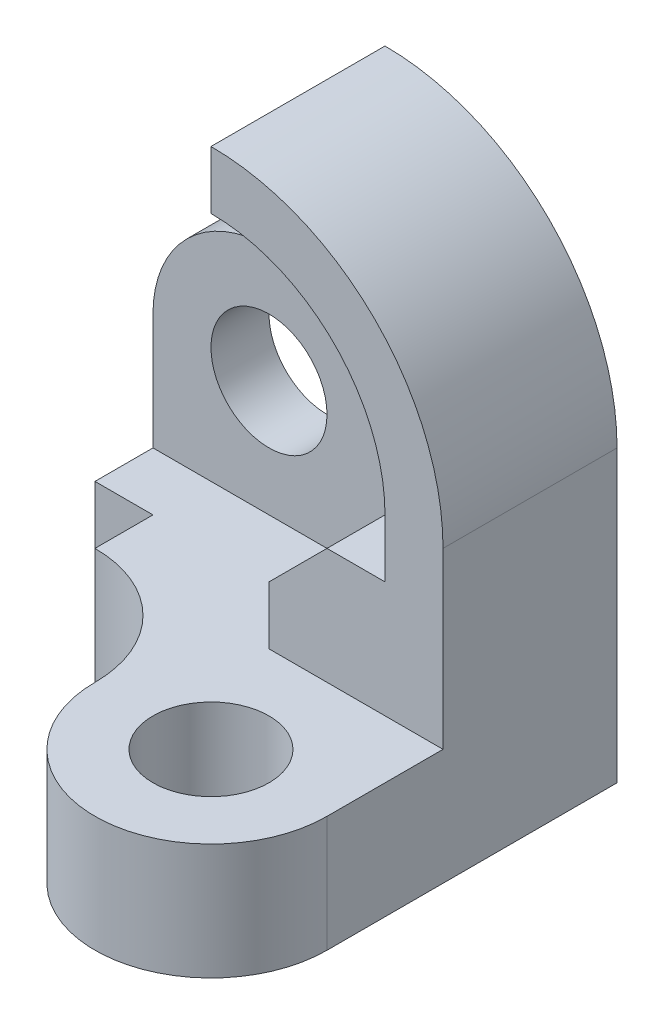
ISO-10303-21;
HEADER;
FILE_DESCRIPTION(('STEP AP214'),'2;1');
FILE_NAME('part.step','',(''),(''),'','','');
FILE_SCHEMA(('AUTOMOTIVE_DESIGN { 1 0 10303 214 1 1 1 1 }'));
ENDSEC;
DATA;
#1=APPLICATION_CONTEXT('core data for automotive mechanical design processes');
#2=APPLICATION_PROTOCOL_DEFINITION('international standard','automotive_design',2000,#1);
#3=PRODUCT_CONTEXT('',#1,'mechanical');
#4=PRODUCT('Part','Part','',(#3));
#5=PRODUCT_RELATED_PRODUCT_CATEGORY('part','',(#4));
#6=PRODUCT_DEFINITION_FORMATION('','',#4);
#7=PRODUCT_DEFINITION_CONTEXT('part definition',#1,'design');
#8=PRODUCT_DEFINITION('design','',#6,#7);
#9=PRODUCT_DEFINITION_SHAPE('','',#8);
#10=(LENGTH_UNIT() NAMED_UNIT(*) SI_UNIT(.MILLI.,.METRE.));
#11=(NAMED_UNIT(*) PLANE_ANGLE_UNIT() SI_UNIT($,.RADIAN.));
#12=(NAMED_UNIT(*) SI_UNIT($,.STERADIAN.) SOLID_ANGLE_UNIT());
#13=UNCERTAINTY_MEASURE_WITH_UNIT(LENGTH_MEASURE(1.E-05),#10,'distance_accuracy_value','');
#14=(GEOMETRIC_REPRESENTATION_CONTEXT(3) GLOBAL_UNCERTAINTY_ASSIGNED_CONTEXT((#13)) GLOBAL_UNIT_ASSIGNED_CONTEXT((#10,
#11,#12)) REPRESENTATION_CONTEXT('',''));
#15=CARTESIAN_POINT('',(0.,0.,0.));
#16=DIRECTION('',(0.,0.,1.));
#17=DIRECTION('',(1.,0.,0.));
#18=AXIS2_PLACEMENT_3D('',#15,#16,#17);
#19=CARTESIAN_POINT('',(0.,0.,10.));
#20=DIRECTION('',(0.,0.,-1.));
#21=DIRECTION('',(-1.,0.,0.));
#22=AXIS2_PLACEMENT_3D('',#19,#20,#21);
#23=PLANE('',#22);
#24=CARTESIAN_POINT('',(-10.,-10.,10.));
#25=DIRECTION('',(0.,0.,1.));
#26=DIRECTION('',(1.,0.,0.));
#27=AXIS2_PLACEMENT_3D('',#24,#25,#26);
#28=CIRCLE('',#27,10.);
#29=CARTESIAN_POINT('',(0.,-10.,10.));
#30=VERTEX_POINT('',#29);
#31=EDGE_CURVE('E207',#30,#30,#28,.T.);
#32=ORIENTED_EDGE('',*,*,#31,.F.);
#33=EDGE_LOOP('',(#32));
#34=FACE_BOUND('',#33,.T.);
#35=DIRECTION('',(-1.,0.,0.));
#36=VECTOR('',#35,1.);
#37=CARTESIAN_POINT('',(40.,-30.,10.));
#38=LINE('',#37,#36);
#39=CARTESIAN_POINT('',(10.,-30.,10.));
#40=VERTEX_POINT('',#39);
#41=CARTESIAN_POINT('',(-30.,-30.,10.));
#42=VERTEX_POINT('',#41);
#43=EDGE_CURVE('E200',#40,#42,#38,.T.);
#44=ORIENTED_EDGE('',*,*,#43,.F.);
#45=DIRECTION('',(0.,1.,0.));
#46=VECTOR('',#45,1.);
#47=CARTESIAN_POINT('',(10.,-20.,10.));
#48=LINE('',#47,#46);
#49=CARTESIAN_POINT('',(10.,-20.,10.));
#50=VERTEX_POINT('',#49);
#51=EDGE_CURVE('E243',#40,#50,#48,.T.);
#52=ORIENTED_EDGE('',*,*,#51,.T.);
#53=DIRECTION('',(0.707106781186547,0.707106781186548,0.));
#54=VECTOR('',#53,1.);
#55=CARTESIAN_POINT('',(20.,-10.,10.));
#56=LINE('',#55,#54);
#57=CARTESIAN_POINT('',(20.,-10.,10.));
#58=VERTEX_POINT('',#57);
#59=EDGE_CURVE('E245',#50,#58,#56,.T.);
#60=ORIENTED_EDGE('',*,*,#59,.T.);
#61=DIRECTION('',(1.,0.,0.));
#62=VECTOR('',#61,1.);
#63=CARTESIAN_POINT('',(30.,-10.,10.));
#64=LINE('',#63,#62);
#65=CARTESIAN_POINT('',(30.,-10.,10.));
#66=VERTEX_POINT('',#65);
#67=EDGE_CURVE('E247',#58,#66,#64,.T.);
#68=ORIENTED_EDGE('',*,*,#67,.T.);
#69=DIRECTION('',(0.,1.,0.));
#70=VECTOR('',#69,1.);
#71=CARTESIAN_POINT('',(30.,0.,10.));
#72=LINE('',#71,#70);
#73=CARTESIAN_POINT('',(30.,0.,10.));
#74=VERTEX_POINT('',#73);
#75=EDGE_CURVE('E249',#66,#74,#72,.T.);
#76=ORIENTED_EDGE('',*,*,#75,.T.);
#77=CARTESIAN_POINT('',(0.,0.,10.));
#78=DIRECTION('',(0.,0.,-1.));
#79=DIRECTION('',(-1.,0.,0.));
#80=AXIS2_PLACEMENT_3D('',#77,#78,#79);
#81=CIRCLE('',#80,30.);
#82=CARTESIAN_POINT('',(0.,30.,10.));
#83=VERTEX_POINT('',#82);
#84=EDGE_CURVE('E251',#74,#83,#81,.F.);
#85=ORIENTED_EDGE('',*,*,#84,.T.);
#86=DIRECTION('',(0.,-1.,0.));
#87=VECTOR('',#86,1.);
#88=CARTESIAN_POINT('',(0.,40.,10.));
#89=LINE('',#88,#87);
#90=CARTESIAN_POINT('',(0.,10.,10.));
#91=VERTEX_POINT('',#90);
#92=EDGE_CURVE('E213',#83,#91,#89,.T.);
#93=ORIENTED_EDGE('',*,*,#92,.T.);
#94=DIRECTION('',(-1.,0.,0.));
#95=VECTOR('',#94,1.);
#96=CARTESIAN_POINT('',(0.,10.,10.));
#97=LINE('',#96,#95);
#98=CARTESIAN_POINT('',(-10.,10.,10.));
#99=VERTEX_POINT('',#98);
#100=EDGE_CURVE('E215',#91,#99,#97,.T.);
#101=ORIENTED_EDGE('',*,*,#100,.T.);
#102=CARTESIAN_POINT('',(-10.,-10.,10.));
#103=DIRECTION('',(0.,0.,1.));
#104=DIRECTION('',(1.,0.,0.));
#105=AXIS2_PLACEMENT_3D('',#102,#103,#104);
#106=CIRCLE('',#105,20.);
#107=CARTESIAN_POINT('',(-30.,-10.,10.));
#108=VERTEX_POINT('',#107);
#109=EDGE_CURVE('E218',#99,#108,#106,.T.);
#110=ORIENTED_EDGE('',*,*,#109,.T.);
#111=DIRECTION('',(0.,-1.,0.));
#112=VECTOR('',#111,1.);
#113=CARTESIAN_POINT('',(-30.,-10.,10.));
#114=LINE('',#113,#112);
#115=EDGE_CURVE('E220',#108,#42,#114,.T.);
#116=ORIENTED_EDGE('',*,*,#115,.T.);
#117=EDGE_LOOP('',(#44,#52,#60,#68,#76,#85,#93,#101,#110,#116));
#118=FACE_BOUND('',#117,.T.);
#119=ADVANCED_FACE('F33',(#34,#118),#23,.F.);
#120=CARTESIAN_POINT('',(0.,0.,30.));
#121=DIRECTION('',(0.,0.,-1.));
#122=DIRECTION('',(-1.,0.,0.));
#123=AXIS2_PLACEMENT_3D('',#120,#121,#122);
#124=CYLINDRICAL_SURFACE('',#123,30.);
#125=ORIENTED_EDGE('',*,*,#84,.F.);
#126=DIRECTION('',(0.,0.,-1.));
#127=VECTOR('',#126,1.);
#128=CARTESIAN_POINT('',(30.,0.,30.));
#129=LINE('',#128,#127);
#130=CARTESIAN_POINT('',(30.,0.,30.));
#131=VERTEX_POINT('',#130);
#132=EDGE_CURVE('E295',#131,#74,#129,.T.);
#133=ORIENTED_EDGE('',*,*,#132,.F.);
#134=CARTESIAN_POINT('',(0.,0.,30.));
#135=DIRECTION('',(0.,0.,-1.));
#136=DIRECTION('',(1.,0.,0.));
#137=AXIS2_PLACEMENT_3D('',#134,#135,#136);
#138=CIRCLE('',#137,30.);
#139=CARTESIAN_POINT('',(0.,30.,30.));
#140=VERTEX_POINT('',#139);
#141=EDGE_CURVE('E260',#140,#131,#138,.T.);
#142=ORIENTED_EDGE('',*,*,#141,.F.);
#143=DIRECTION('',(0.,0.,-1.));
#144=VECTOR('',#143,1.);
#145=CARTESIAN_POINT('',(0.,30.,30.));
#146=LINE('',#145,#144);
#147=EDGE_CURVE('E41',#140,#83,#146,.T.);
#148=ORIENTED_EDGE('',*,*,#147,.T.);
#149=EDGE_LOOP('',(#125,#133,#142,#148));
#150=FACE_BOUND('',#149,.T.);
#151=ADVANCED_FACE('F302',(#150),#124,.F.);
#152=CARTESIAN_POINT('',(30.,0.,30.));
#153=DIRECTION('',(1.,0.,0.));
#154=DIRECTION('',(0.,0.,-1.));
#155=AXIS2_PLACEMENT_3D('',#152,#153,#154);
#156=PLANE('',#155);
#157=ORIENTED_EDGE('',*,*,#75,.F.);
#158=DIRECTION('',(0.,0.,-1.));
#159=VECTOR('',#158,1.);
#160=CARTESIAN_POINT('',(30.,-10.,30.));
#161=LINE('',#160,#159);
#162=CARTESIAN_POINT('',(30.,-10.,30.));
#163=VERTEX_POINT('',#162);
#164=EDGE_CURVE('E292',#163,#66,#161,.T.);
#165=ORIENTED_EDGE('',*,*,#164,.F.);
#166=DIRECTION('',(0.,-1.,0.));
#167=VECTOR('',#166,1.);
#168=CARTESIAN_POINT('',(30.,0.,30.));
#169=LINE('',#168,#167);
#170=EDGE_CURVE('E262',#131,#163,#169,.T.);
#171=ORIENTED_EDGE('',*,*,#170,.F.);
#172=ORIENTED_EDGE('',*,*,#132,.T.);
#173=EDGE_LOOP('',(#157,#165,#171,#172));
#174=FACE_BOUND('',#173,.T.);
#175=ADVANCED_FACE('F315',(#174),#156,.F.);
#176=CARTESIAN_POINT('',(30.,-10.,30.));
#177=DIRECTION('',(0.,-1.,0.));
#178=DIRECTION('',(0.,0.,-1.));
#179=AXIS2_PLACEMENT_3D('',#176,#177,#178);
#180=PLANE('',#179);
#181=ORIENTED_EDGE('',*,*,#67,.F.);
#182=DIRECTION('',(0.,0.,-1.));
#183=VECTOR('',#182,1.);
#184=CARTESIAN_POINT('',(20.,-10.,30.));
#185=LINE('',#184,#183);
#186=CARTESIAN_POINT('',(20.,-10.,30.));
#187=VERTEX_POINT('',#186);
#188=EDGE_CURVE('E289',#187,#58,#185,.T.);
#189=ORIENTED_EDGE('',*,*,#188,.F.);
#190=DIRECTION('',(-1.,0.,0.));
#191=VECTOR('',#190,1.);
#192=CARTESIAN_POINT('',(30.,-10.,30.));
#193=LINE('',#192,#191);
#194=EDGE_CURVE('E264',#163,#187,#193,.T.);
#195=ORIENTED_EDGE('',*,*,#194,.F.);
#196=ORIENTED_EDGE('',*,*,#164,.T.);
#197=EDGE_LOOP('',(#181,#189,#195,#196));
#198=FACE_BOUND('',#197,.T.);
#199=ADVANCED_FACE('F319',(#198),#180,.F.);
#200=CARTESIAN_POINT('',(20.,-10.,30.));
#201=DIRECTION('',(0.707106781186548,-0.707106781186547,0.));
#202=DIRECTION('',(0.707106781186547,0.707106781186548,0.));
#203=AXIS2_PLACEMENT_3D('',#200,#201,#202);
#204=PLANE('',#203);
#205=ORIENTED_EDGE('',*,*,#59,.F.);
#206=DIRECTION('',(0.,0.,-1.));
#207=VECTOR('',#206,1.);
#208=CARTESIAN_POINT('',(10.,-20.,30.));
#209=LINE('',#208,#207);
#210=CARTESIAN_POINT('',(10.,-20.,30.));
#211=VERTEX_POINT('',#210);
#212=EDGE_CURVE('E286',#211,#50,#209,.T.);
#213=ORIENTED_EDGE('',*,*,#212,.F.);
#214=DIRECTION('',(-0.707106781186547,-0.707106781186548,0.));
#215=VECTOR('',#214,1.);
#216=CARTESIAN_POINT('',(20.,-10.,30.));
#217=LINE('',#216,#215);
#218=EDGE_CURVE('E266',#187,#211,#217,.T.);
#219=ORIENTED_EDGE('',*,*,#218,.F.);
#220=ORIENTED_EDGE('',*,*,#188,.T.);
#221=EDGE_LOOP('',(#205,#213,#219,#220));
#222=FACE_BOUND('',#221,.T.);
#223=ADVANCED_FACE('F353',(#222),#204,.F.);
#224=CARTESIAN_POINT('',(10.,-20.,30.));
#225=DIRECTION('',(1.,0.,0.));
#226=DIRECTION('',(0.,0.,-1.));
#227=AXIS2_PLACEMENT_3D('',#224,#225,#226);
#228=PLANE('',#227);
#229=ORIENTED_EDGE('',*,*,#51,.F.);
#230=DIRECTION('',(0.,0.,-1.));
#231=VECTOR('',#230,1.);
#232=CARTESIAN_POINT('',(10.,-30.,30.));
#233=LINE('',#232,#231);
#234=CARTESIAN_POINT('',(10.,-30.,30.));
#235=VERTEX_POINT('',#234);
#236=EDGE_CURVE('E283',#235,#40,#233,.T.);
#237=ORIENTED_EDGE('',*,*,#236,.F.);
#238=DIRECTION('',(0.,-1.,0.));
#239=VECTOR('',#238,1.);
#240=CARTESIAN_POINT('',(10.,-20.,30.));
#241=LINE('',#240,#239);
#242=EDGE_CURVE('E268',#211,#235,#241,.T.);
#243=ORIENTED_EDGE('',*,*,#242,.F.);
#244=ORIENTED_EDGE('',*,*,#212,.T.);
#245=EDGE_LOOP('',(#229,#237,#243,#244));
#246=FACE_BOUND('',#245,.T.);
#247=ADVANCED_FACE('F350',(#246),#228,.F.);
#248=CARTESIAN_POINT('',(0.,0.,30.));
#249=DIRECTION('',(0.,0.,-1.));
#250=DIRECTION('',(-1.,0.,0.));
#251=AXIS2_PLACEMENT_3D('',#248,#249,#250);
#252=CYLINDRICAL_SURFACE('',#251,40.);
#253=CARTESIAN_POINT('',(0.,0.,0.));
#254=DIRECTION('',(0.,0.,1.));
#255=DIRECTION('',(1.,0.,0.));
#256=AXIS2_PLACEMENT_3D('',#253,#254,#255);
#257=CIRCLE('',#256,40.);
#258=CARTESIAN_POINT('',(40.,0.,0.));
#259=VERTEX_POINT('',#258);
#260=CARTESIAN_POINT('',(0.,40.,0.));
#261=VERTEX_POINT('',#260);
#262=EDGE_CURVE('E253',#259,#261,#257,.T.);
#263=ORIENTED_EDGE('',*,*,#262,.T.);
#264=DIRECTION('',(0.,0.,-1.));
#265=VECTOR('',#264,1.);
#266=CARTESIAN_POINT('',(0.,40.,30.));
#267=LINE('',#266,#265);
#268=CARTESIAN_POINT('',(0.,40.,30.));
#269=VERTEX_POINT('',#268);
#270=EDGE_CURVE('E11',#269,#261,#267,.T.);
#271=ORIENTED_EDGE('',*,*,#270,.F.);
#272=CARTESIAN_POINT('',(0.,0.,30.));
#273=DIRECTION('',(0.,0.,1.));
#274=DIRECTION('',(1.,0.,0.));
#275=AXIS2_PLACEMENT_3D('',#272,#273,#274);
#276=CIRCLE('',#275,40.);
#277=CARTESIAN_POINT('',(40.,0.,30.));
#278=VERTEX_POINT('',#277);
#279=EDGE_CURVE('E254',#278,#269,#276,.T.);
#280=ORIENTED_EDGE('',*,*,#279,.F.);
#281=DIRECTION('',(0.,0.,-1.));
#282=VECTOR('',#281,1.);
#283=CARTESIAN_POINT('',(40.,0.,30.));
#284=LINE('',#283,#282);
#285=EDGE_CURVE('E275',#278,#259,#284,.T.);
#286=ORIENTED_EDGE('',*,*,#285,.T.);
#287=EDGE_LOOP('',(#263,#271,#280,#286));
#288=FACE_BOUND('',#287,.T.);
#289=ADVANCED_FACE('F35',(#288),#252,.T.);
#290=CARTESIAN_POINT('',(0.,30.,30.));
#291=DIRECTION('',(1.,0.,0.));
#292=DIRECTION('',(0.,0.,-1.));
#293=AXIS2_PLACEMENT_3D('',#290,#291,#292);
#294=PLANE('',#293);
#295=DIRECTION('',(0.,-1.,0.));
#296=VECTOR('',#295,1.);
#297=CARTESIAN_POINT('',(0.,30.,0.));
#298=LINE('',#297,#296);
#299=CARTESIAN_POINT('',(0.,10.,0.));
#300=VERTEX_POINT('',#299);
#301=EDGE_CURVE('E278',#261,#300,#298,.T.);
#302=ORIENTED_EDGE('',*,*,#301,.T.);
#303=DIRECTION('',(0.,0.,-1.));
#304=VECTOR('',#303,1.);
#305=CARTESIAN_POINT('',(0.,10.,10.));
#306=LINE('',#305,#304);
#307=EDGE_CURVE('E240',#91,#300,#306,.T.);
#308=ORIENTED_EDGE('',*,*,#307,.F.);
#309=ORIENTED_EDGE('',*,*,#92,.F.);
#310=ORIENTED_EDGE('',*,*,#147,.F.);
#311=DIRECTION('',(0.,-1.,0.));
#312=VECTOR('',#311,1.);
#313=CARTESIAN_POINT('',(0.,30.,30.));
#314=LINE('',#313,#312);
#315=EDGE_CURVE('E257',#269,#140,#314,.T.);
#316=ORIENTED_EDGE('',*,*,#315,.F.);
#317=ORIENTED_EDGE('',*,*,#270,.T.);
#318=EDGE_LOOP('',(#302,#308,#309,#310,#316,#317));
#319=FACE_BOUND('',#318,.T.);
#320=ADVANCED_FACE('F306',(#319),#294,.F.);
#321=CARTESIAN_POINT('',(40.,-30.,30.));
#322=DIRECTION('',(-1.,0.,0.));
#323=DIRECTION('',(0.,0.,1.));
#324=AXIS2_PLACEMENT_3D('',#321,#322,#323);
#325=PLANE('',#324);
#326=DIRECTION('',(0.,0.,-1.));
#327=VECTOR('',#326,1.);
#328=CARTESIAN_POINT('',(40.,-30.,80.));
#329=LINE('',#328,#327);
#330=CARTESIAN_POINT('',(40.,-30.,50.));
#331=VERTEX_POINT('',#330);
#332=CARTESIAN_POINT('',(40.,-30.,30.));
#333=VERTEX_POINT('',#332);
#334=EDGE_CURVE('E204',#331,#333,#329,.T.);
#335=ORIENTED_EDGE('',*,*,#334,.F.);
#336=DIRECTION('',(0.,1.,0.));
#337=VECTOR('',#336,1.);
#338=CARTESIAN_POINT('',(40.,-80.,50.));
#339=LINE('',#338,#337);
#340=CARTESIAN_POINT('',(40.,-50.,50.));
#341=VERTEX_POINT('',#340);
#342=EDGE_CURVE('E185',#341,#331,#339,.T.);
#343=ORIENTED_EDGE('',*,*,#342,.F.);
#344=DIRECTION('',(0.,0.,-1.));
#345=VECTOR('',#344,1.);
#346=CARTESIAN_POINT('',(40.,-50.,10.));
#347=LINE('',#346,#345);
#348=CARTESIAN_POINT('',(40.,-50.,0.));
#349=VERTEX_POINT('',#348);
#350=EDGE_CURVE('E222',#341,#349,#347,.T.);
#351=ORIENTED_EDGE('',*,*,#350,.T.);
#352=DIRECTION('',(0.,1.,0.));
#353=VECTOR('',#352,1.);
#354=CARTESIAN_POINT('',(40.,-30.,0.));
#355=LINE('',#354,#353);
#356=EDGE_CURVE('E258',#349,#259,#355,.T.);
#357=ORIENTED_EDGE('',*,*,#356,.T.);
#358=ORIENTED_EDGE('',*,*,#285,.F.);
#359=DIRECTION('',(0.,1.,0.));
#360=VECTOR('',#359,1.);
#361=CARTESIAN_POINT('',(40.,-30.,30.));
#362=LINE('',#361,#360);
#363=EDGE_CURVE('E273',#333,#278,#362,.T.);
#364=ORIENTED_EDGE('',*,*,#363,.F.);
#365=EDGE_LOOP('',(#335,#343,#351,#357,#358,#364));
#366=FACE_BOUND('',#365,.T.);
#367=ADVANCED_FACE('F389',(#366),#325,.F.);
#368=CARTESIAN_POINT('',(0.,0.,30.));
#369=DIRECTION('',(0.,0.,1.));
#370=DIRECTION('',(1.,0.,0.));
#371=AXIS2_PLACEMENT_3D('',#368,#369,#370);
#372=PLANE('',#371);
#373=ORIENTED_EDGE('',*,*,#279,.T.);
#374=ORIENTED_EDGE('',*,*,#315,.T.);
#375=ORIENTED_EDGE('',*,*,#141,.T.);
#376=ORIENTED_EDGE('',*,*,#170,.T.);
#377=ORIENTED_EDGE('',*,*,#194,.T.);
#378=ORIENTED_EDGE('',*,*,#218,.T.);
#379=ORIENTED_EDGE('',*,*,#242,.T.);
#380=DIRECTION('',(1.,0.,0.));
#381=VECTOR('',#380,1.);
#382=CARTESIAN_POINT('',(10.,-30.,30.));
#383=LINE('',#382,#381);
#384=EDGE_CURVE('E270',#235,#333,#383,.T.);
#385=ORIENTED_EDGE('',*,*,#384,.T.);
#386=ORIENTED_EDGE('',*,*,#363,.T.);
#387=EDGE_LOOP('',(#373,#374,#375,#376,#377,#378,#379,#385,#386));
#388=FACE_BOUND('',#387,.T.);
#389=ADVANCED_FACE('F323',(#388),#372,.T.);
#390=CARTESIAN_POINT('',(0.,0.,0.));
#391=DIRECTION('',(0.,0.,1.));
#392=DIRECTION('',(1.,0.,0.));
#393=AXIS2_PLACEMENT_3D('',#390,#391,#392);
#394=PLANE('',#393);
#395=ORIENTED_EDGE('',*,*,#262,.F.);
#396=ORIENTED_EDGE('',*,*,#356,.F.);
#397=DIRECTION('',(1.,0.,0.));
#398=VECTOR('',#397,1.);
#399=CARTESIAN_POINT('',(-30.,-50.,0.));
#400=LINE('',#399,#398);
#401=CARTESIAN_POINT('',(-30.,-50.,0.));
#402=VERTEX_POINT('',#401);
#403=EDGE_CURVE('E216',#402,#349,#400,.T.);
#404=ORIENTED_EDGE('',*,*,#403,.F.);
#405=DIRECTION('',(0.,-1.,0.));
#406=VECTOR('',#405,1.);
#407=CARTESIAN_POINT('',(-30.,-10.,0.));
#408=LINE('',#407,#406);
#409=CARTESIAN_POINT('',(-30.,-10.,0.));
#410=VERTEX_POINT('',#409);
#411=EDGE_CURVE('E226',#410,#402,#408,.T.);
#412=ORIENTED_EDGE('',*,*,#411,.F.);
#413=CARTESIAN_POINT('',(-10.,-10.,0.));
#414=DIRECTION('',(0.,0.,1.));
#415=DIRECTION('',(1.,0.,0.));
#416=AXIS2_PLACEMENT_3D('',#413,#414,#415);
#417=CIRCLE('',#416,20.);
#418=CARTESIAN_POINT('',(-10.,10.,0.));
#419=VERTEX_POINT('',#418);
#420=EDGE_CURVE('E224',#419,#410,#417,.T.);
#421=ORIENTED_EDGE('',*,*,#420,.F.);
#422=DIRECTION('',(-1.,0.,0.));
#423=VECTOR('',#422,1.);
#424=CARTESIAN_POINT('',(0.,10.,0.));
#425=LINE('',#424,#423);
#426=EDGE_CURVE('E210',#300,#419,#425,.T.);
#427=ORIENTED_EDGE('',*,*,#426,.F.);
#428=ORIENTED_EDGE('',*,*,#301,.F.);
#429=EDGE_LOOP('',(#395,#396,#404,#412,#421,#427,#428));
#430=FACE_BOUND('',#429,.T.);
#431=CARTESIAN_POINT('',(-10.,-10.,0.));
#432=DIRECTION('',(0.,0.,1.));
#433=DIRECTION('',(1.,0.,0.));
#434=AXIS2_PLACEMENT_3D('',#431,#432,#433);
#435=CIRCLE('',#434,10.);
#436=CARTESIAN_POINT('',(0.,-10.,0.));
#437=VERTEX_POINT('',#436);
#438=EDGE_CURVE('E206',#437,#437,#435,.T.);
#439=ORIENTED_EDGE('',*,*,#438,.T.);
#440=EDGE_LOOP('',(#439));
#441=FACE_BOUND('',#440,.T.);
#442=ADVANCED_FACE('F334',(#430,#441),#394,.F.);
#443=CARTESIAN_POINT('',(0.,10.,10.));
#444=DIRECTION('',(0.,-1.,0.));
#445=DIRECTION('',(1.,0.,0.));
#446=AXIS2_PLACEMENT_3D('',#443,#444,#445);
#447=PLANE('',#446);
#448=ORIENTED_EDGE('',*,*,#426,.T.);
#449=DIRECTION('',(0.,0.,-1.));
#450=VECTOR('',#449,1.);
#451=CARTESIAN_POINT('',(-10.,10.,10.));
#452=LINE('',#451,#450);
#453=EDGE_CURVE('E237',#99,#419,#452,.T.);
#454=ORIENTED_EDGE('',*,*,#453,.F.);
#455=ORIENTED_EDGE('',*,*,#100,.F.);
#456=ORIENTED_EDGE('',*,*,#307,.T.);
#457=EDGE_LOOP('',(#448,#454,#455,#456));
#458=FACE_BOUND('',#457,.T.);
#459=ADVANCED_FACE('F340',(#458),#447,.F.);
#460=CARTESIAN_POINT('',(-10.,-10.,10.));
#461=DIRECTION('',(0.,0.,-1.));
#462=DIRECTION('',(-1.,0.,0.));
#463=AXIS2_PLACEMENT_3D('',#460,#461,#462);
#464=CYLINDRICAL_SURFACE('',#463,20.);
#465=ORIENTED_EDGE('',*,*,#420,.T.);
#466=DIRECTION('',(0.,0.,-1.));
#467=VECTOR('',#466,1.);
#468=CARTESIAN_POINT('',(-30.,-10.,10.));
#469=LINE('',#468,#467);
#470=EDGE_CURVE('E234',#108,#410,#469,.T.);
#471=ORIENTED_EDGE('',*,*,#470,.F.);
#472=ORIENTED_EDGE('',*,*,#109,.F.);
#473=ORIENTED_EDGE('',*,*,#453,.T.);
#474=EDGE_LOOP('',(#465,#471,#472,#473));
#475=FACE_BOUND('',#474,.T.);
#476=ADVANCED_FACE('F343',(#475),#464,.T.);
#477=CARTESIAN_POINT('',(-30.,-10.,10.));
#478=DIRECTION('',(1.,0.,0.));
#479=DIRECTION('',(0.,1.,0.));
#480=AXIS2_PLACEMENT_3D('',#477,#478,#479);
#481=PLANE('',#480);
#482=DIRECTION('',(0.,0.,-1.));
#483=VECTOR('',#482,1.);
#484=CARTESIAN_POINT('',(-30.,-50.,10.));
#485=LINE('',#484,#483);
#486=CARTESIAN_POINT('',(-30.,-50.,19.9999999999998));
#487=VERTEX_POINT('',#486);
#488=EDGE_CURVE('E232',#487,#402,#485,.T.);
#489=ORIENTED_EDGE('',*,*,#488,.F.);
#490=DIRECTION('',(0.,1.,0.));
#491=VECTOR('',#490,1.);
#492=CARTESIAN_POINT('',(-30.,-80.,19.9999999999998));
#493=LINE('',#492,#491);
#494=CARTESIAN_POINT('',(-30.,-30.,19.9999999999998));
#495=VERTEX_POINT('',#494);
#496=EDGE_CURVE('E188',#487,#495,#493,.T.);
#497=ORIENTED_EDGE('',*,*,#496,.T.);
#498=DIRECTION('',(0.,0.,-1.));
#499=VECTOR('',#498,1.);
#500=CARTESIAN_POINT('',(-30.,-30.,80.));
#501=LINE('',#500,#499);
#502=EDGE_CURVE('E56',#495,#42,#501,.T.);
#503=ORIENTED_EDGE('',*,*,#502,.T.);
#504=ORIENTED_EDGE('',*,*,#115,.F.);
#505=ORIENTED_EDGE('',*,*,#470,.T.);
#506=ORIENTED_EDGE('',*,*,#411,.T.);
#507=EDGE_LOOP('',(#489,#497,#503,#504,#505,#506));
#508=FACE_BOUND('',#507,.T.);
#509=ADVANCED_FACE('F379',(#508),#481,.F.);
#510=CARTESIAN_POINT('',(-30.,-50.,10.));
#511=DIRECTION('',(0.,1.,0.));
#512=DIRECTION('',(0.,0.,1.));
#513=AXIS2_PLACEMENT_3D('',#510,#511,#512);
#514=PLANE('',#513);
#515=CARTESIAN_POINT('',(20.,-50.,50.));
#516=DIRECTION('',(0.,1.,0.));
#517=DIRECTION('',(0.,0.,1.));
#518=AXIS2_PLACEMENT_3D('',#515,#516,#517);
#519=CIRCLE('',#518,10.);
#520=CARTESIAN_POINT('',(20.,-50.,60.));
#521=VERTEX_POINT('',#520);
#522=EDGE_CURVE('E401',#521,#521,#519,.T.);
#523=ORIENTED_EDGE('',*,*,#522,.T.);
#524=EDGE_LOOP('',(#523));
#525=FACE_BOUND('',#524,.T.);
#526=ORIENTED_EDGE('',*,*,#350,.F.);
#527=CARTESIAN_POINT('',(20.,-50.,50.));
#528=DIRECTION('',(0.,1.,0.));
#529=DIRECTION('',(0.,0.,1.));
#530=AXIS2_PLACEMENT_3D('',#527,#528,#529);
#531=CIRCLE('',#530,20.);
#532=CARTESIAN_POINT('',(0.,-50.,50.));
#533=VERTEX_POINT('',#532);
#534=EDGE_CURVE('E197',#341,#533,#531,.F.);
#535=ORIENTED_EDGE('',*,*,#534,.T.);
#536=CARTESIAN_POINT('',(-20.,-50.,49.9999999999998));
#537=DIRECTION('',(0.,1.,0.));
#538=DIRECTION('',(0.,0.,1.));
#539=AXIS2_PLACEMENT_3D('',#536,#537,#538);
#540=CIRCLE('',#539,20.);
#541=CARTESIAN_POINT('',(-19.9999999999998,-50.,29.9999999999998));
#542=VERTEX_POINT('',#541);
#543=EDGE_CURVE('E187',#533,#542,#540,.T.);
#544=ORIENTED_EDGE('',*,*,#543,.T.);
#545=DIRECTION('',(0.,0.,-1.));
#546=VECTOR('',#545,1.);
#547=CARTESIAN_POINT('',(-20.0000000000002,-50.,9.9999999999998));
#548=LINE('',#547,#546);
#549=CARTESIAN_POINT('',(-20.,-50.,19.9999999999998));
#550=VERTEX_POINT('',#549);
#551=EDGE_CURVE('E168',#542,#550,#548,.T.);
#552=ORIENTED_EDGE('',*,*,#551,.T.);
#553=DIRECTION('',(-1.,0.,0.));
#554=VECTOR('',#553,1.);
#555=CARTESIAN_POINT('',(-30.,-50.,19.9999999999998));
#556=LINE('',#555,#554);
#557=EDGE_CURVE('E194',#550,#487,#556,.T.);
#558=ORIENTED_EDGE('',*,*,#557,.T.);
#559=ORIENTED_EDGE('',*,*,#488,.T.);
#560=ORIENTED_EDGE('',*,*,#403,.T.);
#561=EDGE_LOOP('',(#526,#535,#544,#552,#558,#559,#560));
#562=FACE_BOUND('',#561,.T.);
#563=ADVANCED_FACE('F376',(#525,#562),#514,.F.);
#564=CARTESIAN_POINT('',(-10.,-10.,10.));
#565=DIRECTION('',(0.,0.,-1.));
#566=DIRECTION('',(-1.,0.,0.));
#567=AXIS2_PLACEMENT_3D('',#564,#565,#566);
#568=CYLINDRICAL_SURFACE('',#567,10.);
#569=ORIENTED_EDGE('',*,*,#31,.T.);
#570=EDGE_LOOP('',(#569));
#571=FACE_BOUND('',#570,.T.);
#572=ORIENTED_EDGE('',*,*,#438,.F.);
#573=EDGE_LOOP('',(#572));
#574=FACE_BOUND('',#573,.T.);
#575=ADVANCED_FACE('F374',(#571,#574),#568,.F.);
#576=CARTESIAN_POINT('',(40.,-30.,80.));
#577=DIRECTION('',(0.,-1.,0.));
#578=DIRECTION('',(0.,0.,-1.));
#579=AXIS2_PLACEMENT_3D('',#576,#577,#578);
#580=PLANE('',#579);
#581=CARTESIAN_POINT('',(20.,-30.,50.));
#582=DIRECTION('',(0.,1.,0.));
#583=DIRECTION('',(0.,0.,1.));
#584=AXIS2_PLACEMENT_3D('',#581,#582,#583);
#585=CIRCLE('',#584,10.);
#586=CARTESIAN_POINT('',(20.,-30.,60.));
#587=VERTEX_POINT('',#586);
#588=EDGE_CURVE('E403',#587,#587,#585,.T.);
#589=ORIENTED_EDGE('',*,*,#588,.F.);
#590=EDGE_LOOP('',(#589));
#591=FACE_BOUND('',#590,.T.);
#592=CARTESIAN_POINT('',(-20.,-30.,49.9999999999998));
#593=DIRECTION('',(0.,1.,0.));
#594=DIRECTION('',(0.,0.,1.));
#595=AXIS2_PLACEMENT_3D('',#592,#593,#594);
#596=CIRCLE('',#595,20.);
#597=CARTESIAN_POINT('',(0.,-30.,50.));
#598=VERTEX_POINT('',#597);
#599=CARTESIAN_POINT('',(-19.9999999999998,-30.,29.9999999999998));
#600=VERTEX_POINT('',#599);
#601=EDGE_CURVE('E175',#598,#600,#596,.T.);
#602=ORIENTED_EDGE('',*,*,#601,.F.);
#603=CARTESIAN_POINT('',(20.,-30.,50.));
#604=DIRECTION('',(0.,-1.,0.));
#605=DIRECTION('',(0.,0.,-1.));
#606=AXIS2_PLACEMENT_3D('',#603,#604,#605);
#607=CIRCLE('',#606,20.);
#608=EDGE_CURVE('E48',#331,#598,#607,.T.);
#609=ORIENTED_EDGE('',*,*,#608,.F.);
#610=ORIENTED_EDGE('',*,*,#334,.T.);
#611=ORIENTED_EDGE('',*,*,#384,.F.);
#612=ORIENTED_EDGE('',*,*,#236,.T.);
#613=ORIENTED_EDGE('',*,*,#43,.T.);
#614=ORIENTED_EDGE('',*,*,#502,.F.);
#615=DIRECTION('',(-1.,0.,0.));
#616=VECTOR('',#615,1.);
#617=CARTESIAN_POINT('',(-20.,-30.,19.9999999999998));
#618=LINE('',#617,#616);
#619=CARTESIAN_POINT('',(-20.,-30.,19.9999999999998));
#620=VERTEX_POINT('',#619);
#621=EDGE_CURVE('E180',#620,#495,#618,.T.);
#622=ORIENTED_EDGE('',*,*,#621,.F.);
#623=DIRECTION('',(0.,0.,-1.));
#624=VECTOR('',#623,1.);
#625=CARTESIAN_POINT('',(-19.9999999999998,-30.,29.9999999999998));
#626=LINE('',#625,#624);
#627=EDGE_CURVE('E165',#600,#620,#626,.T.);
#628=ORIENTED_EDGE('',*,*,#627,.F.);
#629=EDGE_LOOP('',(#602,#609,#610,#611,#612,#613,#614,#622,#628));
#630=FACE_BOUND('',#629,.T.);
#631=ADVANCED_FACE('F179',(#591,#630),#580,.F.);
#632=CARTESIAN_POINT('',(20.,-80.,50.));
#633=DIRECTION('',(0.,1.,0.));
#634=DIRECTION('',(0.,0.,1.));
#635=AXIS2_PLACEMENT_3D('',#632,#633,#634);
#636=CYLINDRICAL_SURFACE('',#635,20.);
#637=ORIENTED_EDGE('',*,*,#342,.T.);
#638=ORIENTED_EDGE('',*,*,#608,.T.);
#639=DIRECTION('',(0.,1.,0.));
#640=VECTOR('',#639,1.);
#641=CARTESIAN_POINT('',(0.,-80.,50.));
#642=LINE('',#641,#640);
#643=EDGE_CURVE('E172',#533,#598,#642,.T.);
#644=ORIENTED_EDGE('',*,*,#643,.F.);
#645=ORIENTED_EDGE('',*,*,#534,.F.);
#646=EDGE_LOOP('',(#637,#638,#644,#645));
#647=FACE_BOUND('',#646,.T.);
#648=ADVANCED_FACE('F413',(#647),#636,.T.);
#649=CARTESIAN_POINT('',(-20.,-80.,19.9999999999998));
#650=DIRECTION('',(0.,0.,-1.));
#651=DIRECTION('',(-1.,0.,0.));
#652=AXIS2_PLACEMENT_3D('',#649,#650,#651);
#653=PLANE('',#652);
#654=DIRECTION('',(0.,1.,0.));
#655=VECTOR('',#654,1.);
#656=CARTESIAN_POINT('',(-20.,-80.,19.9999999999998));
#657=LINE('',#656,#655);
#658=EDGE_CURVE('E171',#550,#620,#657,.T.);
#659=ORIENTED_EDGE('',*,*,#658,.T.);
#660=ORIENTED_EDGE('',*,*,#621,.T.);
#661=ORIENTED_EDGE('',*,*,#496,.F.);
#662=ORIENTED_EDGE('',*,*,#557,.F.);
#663=EDGE_LOOP('',(#659,#660,#661,#662));
#664=FACE_BOUND('',#663,.T.);
#665=ADVANCED_FACE('F417',(#664),#653,.F.);
#666=CARTESIAN_POINT('',(-19.9999999999998,-80.,29.9999999999998));
#667=DIRECTION('',(1.,0.,0.));
#668=DIRECTION('',(0.,0.,-1.));
#669=AXIS2_PLACEMENT_3D('',#666,#667,#668);
#670=PLANE('',#669);
#671=DIRECTION('',(0.,1.,0.));
#672=VECTOR('',#671,1.);
#673=CARTESIAN_POINT('',(-19.9999999999998,-80.,29.9999999999998));
#674=LINE('',#673,#672);
#675=EDGE_CURVE('E160',#542,#600,#674,.T.);
#676=ORIENTED_EDGE('',*,*,#675,.T.);
#677=ORIENTED_EDGE('',*,*,#627,.T.);
#678=ORIENTED_EDGE('',*,*,#658,.F.);
#679=ORIENTED_EDGE('',*,*,#551,.F.);
#680=EDGE_LOOP('',(#676,#677,#678,#679));
#681=FACE_BOUND('',#680,.T.);
#682=ADVANCED_FACE('F162',(#681),#670,.F.);
#683=CARTESIAN_POINT('',(-20.,-80.,49.9999999999998));
#684=DIRECTION('',(0.,1.,0.));
#685=DIRECTION('',(0.,0.,1.));
#686=AXIS2_PLACEMENT_3D('',#683,#684,#685);
#687=CYLINDRICAL_SURFACE('',#686,20.);
#688=ORIENTED_EDGE('',*,*,#643,.T.);
#689=ORIENTED_EDGE('',*,*,#601,.T.);
#690=ORIENTED_EDGE('',*,*,#675,.F.);
#691=ORIENTED_EDGE('',*,*,#543,.F.);
#692=EDGE_LOOP('',(#688,#689,#690,#691));
#693=FACE_BOUND('',#692,.T.);
#694=ADVANCED_FACE('F176',(#693),#687,.F.);
#695=CARTESIAN_POINT('',(20.,-80.,50.));
#696=DIRECTION('',(0.,1.,0.));
#697=DIRECTION('',(0.,0.,1.));
#698=AXIS2_PLACEMENT_3D('',#695,#696,#697);
#699=CYLINDRICAL_SURFACE('',#698,10.);
#700=ORIENTED_EDGE('',*,*,#588,.T.);
#701=EDGE_LOOP('',(#700));
#702=FACE_BOUND('',#701,.T.);
#703=ORIENTED_EDGE('',*,*,#522,.F.);
#704=EDGE_LOOP('',(#703));
#705=FACE_BOUND('',#704,.T.);
#706=ADVANCED_FACE('F409',(#702,#705),#699,.F.);
#707=CLOSED_SHELL('',(#119,#151,#175,#199,#223,#247,#289,#320,#367,#389,#442,#459,#476,#509,
#563,#575,#631,#648,#665,#682,#694,#706));
#708=MANIFOLD_SOLID_BREP('B2',#707);
#709=ADVANCED_BREP_SHAPE_REPRESENTATION('',(#18,#708),#14);
#710=SHAPE_DEFINITION_REPRESENTATION(#9,#709);
ENDSEC;
END-ISO-10303-21;
